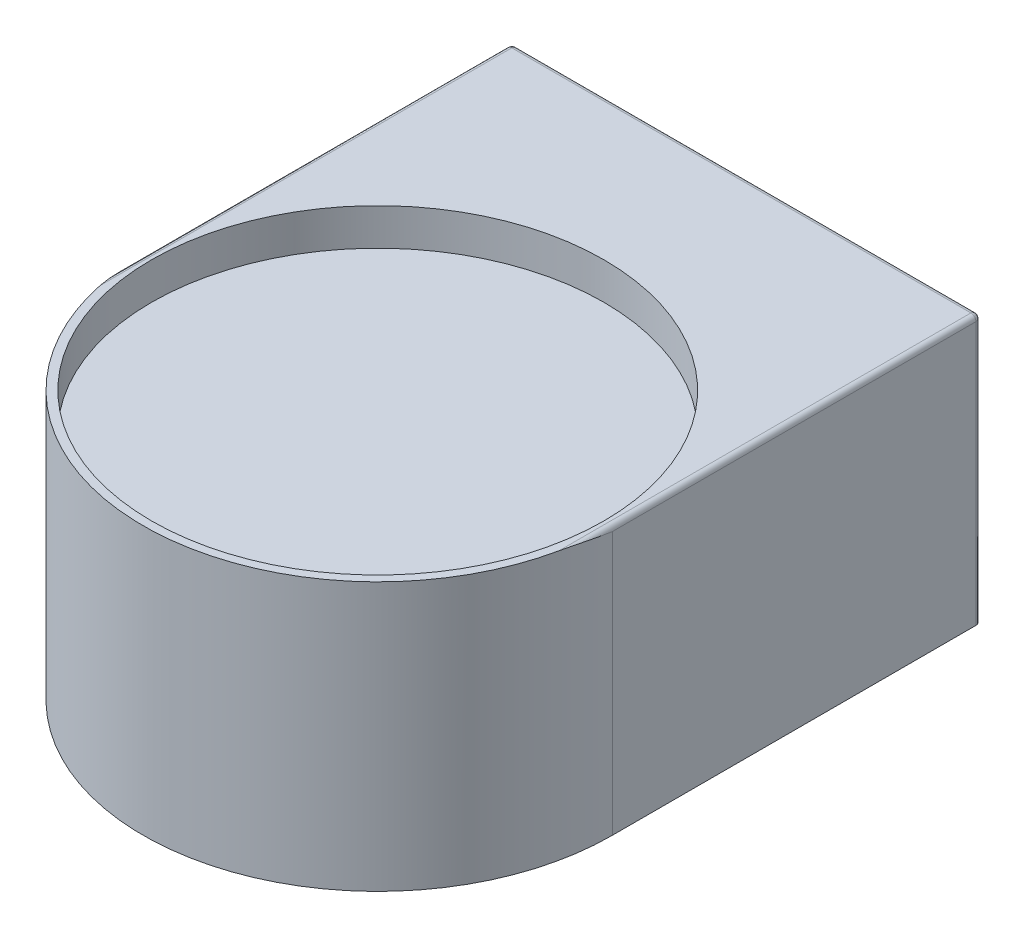
ISO-10303-21;
HEADER;
FILE_DESCRIPTION(('STEP AP214'),'2;1');
FILE_NAME('part.step','',(''),(''),'','','');
FILE_SCHEMA(('AUTOMOTIVE_DESIGN { 1 0 10303 214 1 1 1 1 }'));
ENDSEC;
DATA;
#1=APPLICATION_CONTEXT('core data for automotive mechanical design processes');
#2=APPLICATION_PROTOCOL_DEFINITION('international standard','automotive_design',2000,#1);
#3=PRODUCT_CONTEXT('',#1,'mechanical');
#4=PRODUCT('Part','Part','',(#3));
#5=PRODUCT_RELATED_PRODUCT_CATEGORY('part','',(#4));
#6=PRODUCT_DEFINITION_FORMATION('','',#4);
#7=PRODUCT_DEFINITION_CONTEXT('part definition',#1,'design');
#8=PRODUCT_DEFINITION('design','',#6,#7);
#9=PRODUCT_DEFINITION_SHAPE('','',#8);
#10=(LENGTH_UNIT() NAMED_UNIT(*) SI_UNIT(.MILLI.,.METRE.));
#11=(NAMED_UNIT(*) PLANE_ANGLE_UNIT() SI_UNIT($,.RADIAN.));
#12=(NAMED_UNIT(*) SI_UNIT($,.STERADIAN.) SOLID_ANGLE_UNIT());
#13=UNCERTAINTY_MEASURE_WITH_UNIT(LENGTH_MEASURE(1.E-05),#10,'distance_accuracy_value','');
#14=(GEOMETRIC_REPRESENTATION_CONTEXT(3) GLOBAL_UNCERTAINTY_ASSIGNED_CONTEXT((#13)) GLOBAL_UNIT_ASSIGNED_CONTEXT((#10,
#11,#12)) REPRESENTATION_CONTEXT('',''));
#15=CARTESIAN_POINT('',(0.,0.,0.));
#16=DIRECTION('',(0.,0.,1.));
#17=DIRECTION('',(1.,0.,0.));
#18=AXIS2_PLACEMENT_3D('',#15,#16,#17);
#19=CARTESIAN_POINT('',(0.,-4.69090909090911,0.));
#20=DIRECTION('',(0.,1.,0.));
#21=DIRECTION('',(0.,0.,1.));
#22=AXIS2_PLACEMENT_3D('',#19,#20,#21);
#23=CYLINDRICAL_SURFACE('',#22,135.);
#24=CARTESIAN_POINT('',(0.,160.,0.));
#25=DIRECTION('',(0.,1.,0.));
#26=DIRECTION('',(0.,0.,1.));
#27=AXIS2_PLACEMENT_3D('',#24,#25,#26);
#28=CIRCLE('',#27,135.);
#29=CARTESIAN_POINT('',(0.,160.,135.));
#30=VERTEX_POINT('',#29);
#31=EDGE_CURVE('E240',#30,#30,#28,.T.);
#32=ORIENTED_EDGE('',*,*,#31,.T.);
#33=EDGE_LOOP('',(#32));
#34=FACE_BOUND('',#33,.T.);
#35=CARTESIAN_POINT('',(0.,138.,0.));
#36=DIRECTION('',(0.,-1.,0.));
#37=DIRECTION('',(0.,0.,-1.));
#38=AXIS2_PLACEMENT_3D('',#35,#36,#37);
#39=CIRCLE('',#38,135.);
#40=CARTESIAN_POINT('',(0.,138.,-135.));
#41=VERTEX_POINT('',#40);
#42=EDGE_CURVE('E11',#41,#41,#39,.F.);
#43=ORIENTED_EDGE('',*,*,#42,.F.);
#44=EDGE_LOOP('',(#43));
#45=FACE_BOUND('',#44,.T.);
#46=ADVANCED_FACE('F33',(#34,#45),#23,.F.);
#47=CARTESIAN_POINT('',(0.,160.,0.));
#48=DIRECTION('',(0.,-1.,0.));
#49=DIRECTION('',(0.,0.,-1.));
#50=AXIS2_PLACEMENT_3D('',#47,#48,#49);
#51=CYLINDRICAL_SURFACE('',#50,140.);
#52=CARTESIAN_POINT('',(0.,0.,0.));
#53=DIRECTION('',(0.,1.,0.));
#54=DIRECTION('',(0.,0.,1.));
#55=AXIS2_PLACEMENT_3D('',#52,#53,#54);
#56=CIRCLE('',#55,140.);
#57=CARTESIAN_POINT('',(-140.,0.,0.));
#58=VERTEX_POINT('',#57);
#59=CARTESIAN_POINT('',(140.,0.,0.));
#60=VERTEX_POINT('',#59);
#61=EDGE_CURVE('E112',#58,#60,#56,.T.);
#62=ORIENTED_EDGE('',*,*,#61,.T.);
#63=DIRECTION('',(0.,-1.,0.));
#64=VECTOR('',#63,1.);
#65=CARTESIAN_POINT('',(140.,160.,0.));
#66=LINE('',#65,#64);
#67=CARTESIAN_POINT('',(140.,157.,0.));
#68=VERTEX_POINT('',#67);
#69=EDGE_CURVE('E97',#68,#60,#66,.T.);
#70=ORIENTED_EDGE('',*,*,#69,.F.);
#71=CARTESIAN_POINT('',(137.,160.,28.8270706107991));
#72=CARTESIAN_POINT('',(137.051544541855,159.999996930656,28.5821066152766));
#73=CARTESIAN_POINT('',(137.102431236093,159.998671921808,28.3370077506468));
#74=CARTESIAN_POINT('',(137.202883492568,159.993554952764,27.8465691345094));
#75=CARTESIAN_POINT('',(137.252449076849,159.98976303376,27.6012293870922));
#76=CARTESIAN_POINT('',(137.399145668618,159.97495352466,26.8649445162324));
#77=CARTESIAN_POINT('',(137.49429010377,159.960502088333,26.3736691822973));
#78=CARTESIAN_POINT('',(137.6792335934,159.923615698855,25.3905255481396));
#79=CARTESIAN_POINT('',(137.769033730749,159.901182369483,24.8986573887851));
#80=CARTESIAN_POINT('',(137.943303052374,159.849287414931,23.9143259823607));
#81=CARTESIAN_POINT('',(138.027771938763,159.819825397456,23.4218627036022));
#82=CARTESIAN_POINT('',(138.267017451614,159.724596055001,21.9808094023394));
#83=CARTESIAN_POINT('',(138.414574881376,159.650450560498,21.0315610649272));
#84=CARTESIAN_POINT('',(138.689932418966,159.48394662101,19.131755952694));
#85=CARTESIAN_POINT('',(138.817730700018,159.391586493837,18.1811990650815));
#86=CARTESIAN_POINT('',(139.053649567885,159.192343569326,16.2788651846211));
#87=CARTESIAN_POINT('',(139.161763908695,159.085456180998,15.3270879006664));
#88=CARTESIAN_POINT('',(139.358328106387,158.860271659268,13.4228398194572));
#89=CARTESIAN_POINT('',(139.446777181432,158.741974072496,12.4703689961394));
#90=CARTESIAN_POINT('',(139.682781907951,158.37394531321,9.61140687545686));
#91=CARTESIAN_POINT('',(139.800903089861,158.111160275206,7.70410854604141));
#92=CARTESIAN_POINT('',(139.958987202305,157.569215828585,3.88915605173734));
#93=CARTESIAN_POINT('',(139.998971687232,157.290060957558,1.98150213020023));
#94=CARTESIAN_POINT('',(139.999993471975,157.007225950898,0.049362651041102));
#95=CARTESIAN_POINT('',(139.999999998732,157.00361297224,0.0246813084382035));
#96=CARTESIAN_POINT('',(140.,157.,0.));
#97=B_SPLINE_CURVE_WITH_KNOTS('',3,(#71,#72,#73,#74,#75,#76,#77,#78,#79,#80,#81,#82,#83,#84,#85,
#86,#87,#88,#89,#90,#91,#92,#93,#94,#95,#96),.UNSPECIFIED.,.F.,.F.,(4,2,2,2,2,2,2,2,2,2,2,2,4),
(0.,0.750974288515512,1.5019360377118,3.00366159057737,4.50508181780869,6.00658586397522,
8.89663461183702,11.7869503912648,14.6781817181725,17.5695279718398,23.3544767027828,
29.1378294016918,29.2126625519889),.UNSPECIFIED.);
#98=CARTESIAN_POINT('',(137.,160.,28.8270706107991));
#99=VERTEX_POINT('',#98);
#100=EDGE_CURVE('E141',#68,#99,#97,.F.);
#101=ORIENTED_EDGE('',*,*,#100,.T.);
#102=CARTESIAN_POINT('',(0.,160.,0.));
#103=DIRECTION('',(0.,1.,0.));
#104=DIRECTION('',(0.,0.,1.));
#105=AXIS2_PLACEMENT_3D('',#102,#103,#104);
#106=CIRCLE('',#105,140.);
#107=CARTESIAN_POINT('',(-137.,160.,28.8270706107991));
#108=VERTEX_POINT('',#107);
#109=EDGE_CURVE('E131',#108,#99,#106,.T.);
#110=ORIENTED_EDGE('',*,*,#109,.F.);
#111=CARTESIAN_POINT('',(-137.,160.,28.8270706107991));
#112=CARTESIAN_POINT('',(-137.051544541855,159.999996930656,28.5821066152766));
#113=CARTESIAN_POINT('',(-137.102431236093,159.998671921808,28.3370077506468));
#114=CARTESIAN_POINT('',(-137.202883492568,159.993554952764,27.8465691345094));
#115=CARTESIAN_POINT('',(-137.252449076849,159.98976303376,27.6012293870922));
#116=CARTESIAN_POINT('',(-137.399145668618,159.97495352466,26.8649445162324));
#117=CARTESIAN_POINT('',(-137.49429010377,159.960502088333,26.3736691822973));
#118=CARTESIAN_POINT('',(-137.6792335934,159.923615698855,25.3905255481396));
#119=CARTESIAN_POINT('',(-137.769033730749,159.901182369483,24.8986573887851));
#120=CARTESIAN_POINT('',(-137.943303052374,159.849287414931,23.9143259823607));
#121=CARTESIAN_POINT('',(-138.027771938763,159.819825397456,23.4218627036022));
#122=CARTESIAN_POINT('',(-138.267017451614,159.724596055001,21.9808094023394));
#123=CARTESIAN_POINT('',(-138.414574881376,159.650450560498,21.0315610649272));
#124=CARTESIAN_POINT('',(-138.689932418966,159.48394662101,19.131755952694));
#125=CARTESIAN_POINT('',(-138.817730700018,159.391586493837,18.1811990650815));
#126=CARTESIAN_POINT('',(-139.053649567885,159.192343569326,16.2788651846211));
#127=CARTESIAN_POINT('',(-139.161763908695,159.085456180998,15.3270879006664));
#128=CARTESIAN_POINT('',(-139.358328106387,158.860271659268,13.4228398194572));
#129=CARTESIAN_POINT('',(-139.446777181432,158.741974072496,12.4703689961394));
#130=CARTESIAN_POINT('',(-139.682781907951,158.37394531321,9.61140687545686));
#131=CARTESIAN_POINT('',(-139.800903089861,158.111160275206,7.70410854604141));
#132=CARTESIAN_POINT('',(-139.958987202305,157.569215828585,3.88915605173734));
#133=CARTESIAN_POINT('',(-139.998971687232,157.290060957558,1.98150213020023));
#134=CARTESIAN_POINT('',(-139.999993471975,157.007225950898,0.049362651041102));
#135=CARTESIAN_POINT('',(-139.999999998732,157.00361297224,0.0246813084382035));
#136=CARTESIAN_POINT('',(-140.,157.,0.));
#137=B_SPLINE_CURVE_WITH_KNOTS('',3,(#111,#112,#113,#114,#115,#116,#117,#118,#119,#120,#121,
#122,#123,#124,#125,#126,#127,#128,#129,#130,#131,#132,#133,#134,#135,#136),.UNSPECIFIED.,.F.,
.F.,(4,2,2,2,2,2,2,2,2,2,2,2,4),(0.,0.750974288515512,1.5019360377118,3.00366159057737,
4.50508181780869,6.00658586397522,8.89663461183702,11.7869503912648,14.6781817181725,
17.5695279718398,23.3544767027828,29.1378294016918,29.2126625519889),.UNSPECIFIED.);
#138=CARTESIAN_POINT('',(-140.,157.,0.));
#139=VERTEX_POINT('',#138);
#140=EDGE_CURVE('E147',#108,#139,#137,.T.);
#141=ORIENTED_EDGE('',*,*,#140,.T.);
#142=DIRECTION('',(0.,-1.,0.));
#143=VECTOR('',#142,1.);
#144=CARTESIAN_POINT('',(-140.,160.,0.));
#145=LINE('',#144,#143);
#146=EDGE_CURVE('E106',#139,#58,#145,.T.);
#147=ORIENTED_EDGE('',*,*,#146,.T.);
#148=EDGE_LOOP('',(#62,#70,#101,#110,#141,#147));
#149=FACE_BOUND('',#148,.T.);
#150=ADVANCED_FACE('F35',(#149),#51,.T.);
#151=CARTESIAN_POINT('',(140.,160.,0.));
#152=DIRECTION('',(-1.,0.,0.));
#153=DIRECTION('',(0.,0.,1.));
#154=AXIS2_PLACEMENT_3D('',#151,#152,#153);
#155=PLANE('',#154);
#156=DIRECTION('',(0.,-1.,0.));
#157=VECTOR('',#156,1.);
#158=CARTESIAN_POINT('',(140.,160.,-217.));
#159=LINE('',#158,#157);
#160=CARTESIAN_POINT('',(140.,0.,-217.));
#161=VERTEX_POINT('',#160);
#162=CARTESIAN_POINT('',(140.,157.,-217.));
#163=VERTEX_POINT('',#162);
#164=EDGE_CURVE('E42',#161,#163,#159,.F.);
#165=ORIENTED_EDGE('',*,*,#164,.T.);
#166=DIRECTION('',(0.,0.,-1.));
#167=VECTOR('',#166,1.);
#168=CARTESIAN_POINT('',(140.,157.,0.));
#169=LINE('',#168,#167);
#170=EDGE_CURVE('E101',#163,#68,#169,.F.);
#171=ORIENTED_EDGE('',*,*,#170,.T.);
#172=ORIENTED_EDGE('',*,*,#69,.T.);
#173=DIRECTION('',(0.,0.,-1.));
#174=VECTOR('',#173,1.);
#175=CARTESIAN_POINT('',(140.,0.,0.));
#176=LINE('',#175,#174);
#177=EDGE_CURVE('E100',#60,#161,#176,.T.);
#178=ORIENTED_EDGE('',*,*,#177,.T.);
#179=EDGE_LOOP('',(#165,#171,#172,#178));
#180=FACE_BOUND('',#179,.T.);
#181=ADVANCED_FACE('F99',(#180),#155,.F.);
#182=CARTESIAN_POINT('',(-140.,160.,-220.));
#183=DIRECTION('',(0.,0.,1.));
#184=DIRECTION('',(1.,0.,0.));
#185=AXIS2_PLACEMENT_3D('',#182,#183,#184);
#186=PLANE('',#185);
#187=DIRECTION('',(0.,-1.,0.));
#188=VECTOR('',#187,1.);
#189=CARTESIAN_POINT('',(-137.,160.,-220.));
#190=LINE('',#189,#188);
#191=CARTESIAN_POINT('',(-137.,0.,-220.));
#192=VERTEX_POINT('',#191);
#193=CARTESIAN_POINT('',(-137.,157.,-220.));
#194=VERTEX_POINT('',#193);
#195=EDGE_CURVE('E216',#192,#194,#190,.F.);
#196=ORIENTED_EDGE('',*,*,#195,.T.);
#197=DIRECTION('',(-1.,0.,0.));
#198=VECTOR('',#197,1.);
#199=CARTESIAN_POINT('',(140.,157.,-220.));
#200=LINE('',#199,#198);
#201=CARTESIAN_POINT('',(137.,157.,-220.));
#202=VERTEX_POINT('',#201);
#203=EDGE_CURVE('E56',#194,#202,#200,.F.);
#204=ORIENTED_EDGE('',*,*,#203,.T.);
#205=DIRECTION('',(0.,-1.,0.));
#206=VECTOR('',#205,1.);
#207=CARTESIAN_POINT('',(137.,160.,-220.));
#208=LINE('',#207,#206);
#209=CARTESIAN_POINT('',(137.,0.,-220.));
#210=VERTEX_POINT('',#209);
#211=EDGE_CURVE('E218',#202,#210,#208,.T.);
#212=ORIENTED_EDGE('',*,*,#211,.T.);
#213=DIRECTION('',(-1.,0.,0.));
#214=VECTOR('',#213,1.);
#215=CARTESIAN_POINT('',(-140.,0.,-220.));
#216=LINE('',#215,#214);
#217=EDGE_CURVE('E116',#210,#192,#216,.T.);
#218=ORIENTED_EDGE('',*,*,#217,.T.);
#219=EDGE_LOOP('',(#196,#204,#212,#218));
#220=FACE_BOUND('',#219,.T.);
#221=ADVANCED_FACE('F174',(#220),#186,.F.);
#222=CARTESIAN_POINT('',(-140.,160.,0.));
#223=DIRECTION('',(1.,0.,0.));
#224=DIRECTION('',(0.,0.,-1.));
#225=AXIS2_PLACEMENT_3D('',#222,#223,#224);
#226=PLANE('',#225);
#227=DIRECTION('',(0.,0.,1.));
#228=VECTOR('',#227,1.);
#229=CARTESIAN_POINT('',(-140.,0.,0.));
#230=LINE('',#229,#228);
#231=CARTESIAN_POINT('',(-140.,0.,-217.));
#232=VERTEX_POINT('',#231);
#233=EDGE_CURVE('E129',#232,#58,#230,.T.);
#234=ORIENTED_EDGE('',*,*,#233,.T.);
#235=ORIENTED_EDGE('',*,*,#146,.F.);
#236=DIRECTION('',(0.,0.,1.));
#237=VECTOR('',#236,1.);
#238=CARTESIAN_POINT('',(-140.,157.,-220.));
#239=LINE('',#238,#237);
#240=CARTESIAN_POINT('',(-140.,157.,-217.));
#241=VERTEX_POINT('',#240);
#242=EDGE_CURVE('E220',#139,#241,#239,.F.);
#243=ORIENTED_EDGE('',*,*,#242,.T.);
#244=DIRECTION('',(0.,-1.,0.));
#245=VECTOR('',#244,1.);
#246=CARTESIAN_POINT('',(-140.,160.,-217.));
#247=LINE('',#246,#245);
#248=EDGE_CURVE('E214',#241,#232,#247,.T.);
#249=ORIENTED_EDGE('',*,*,#248,.T.);
#250=EDGE_LOOP('',(#234,#235,#243,#249));
#251=FACE_BOUND('',#250,.T.);
#252=ADVANCED_FACE('F170',(#251),#226,.F.);
#253=CARTESIAN_POINT('',(0.,160.,0.));
#254=DIRECTION('',(0.,1.,0.));
#255=DIRECTION('',(0.,0.,1.));
#256=AXIS2_PLACEMENT_3D('',#253,#254,#255);
#257=PLANE('',#256);
#258=ORIENTED_EDGE('',*,*,#31,.F.);
#259=EDGE_LOOP('',(#258));
#260=FACE_BOUND('',#259,.T.);
#261=DIRECTION('',(-1.,0.,0.));
#262=VECTOR('',#261,1.);
#263=CARTESIAN_POINT('',(-140.,160.,-217.));
#264=LINE('',#263,#262);
#265=CARTESIAN_POINT('',(137.,160.,-217.));
#266=VERTEX_POINT('',#265);
#267=CARTESIAN_POINT('',(-137.,160.,-217.));
#268=VERTEX_POINT('',#267);
#269=EDGE_CURVE('E136',#266,#268,#264,.T.);
#270=ORIENTED_EDGE('',*,*,#269,.T.);
#271=DIRECTION('',(0.,0.,1.));
#272=VECTOR('',#271,1.);
#273=CARTESIAN_POINT('',(-137.,160.,0.));
#274=LINE('',#273,#272);
#275=EDGE_CURVE('E138',#268,#108,#274,.T.);
#276=ORIENTED_EDGE('',*,*,#275,.T.);
#277=ORIENTED_EDGE('',*,*,#109,.T.);
#278=DIRECTION('',(0.,0.,-1.));
#279=VECTOR('',#278,1.);
#280=CARTESIAN_POINT('',(137.,160.,-220.));
#281=LINE('',#280,#279);
#282=EDGE_CURVE('E105',#99,#266,#281,.T.);
#283=ORIENTED_EDGE('',*,*,#282,.T.);
#284=EDGE_LOOP('',(#270,#276,#277,#283));
#285=FACE_BOUND('',#284,.T.);
#286=ADVANCED_FACE('F167',(#260,#285),#257,.T.);
#287=CARTESIAN_POINT('',(0.,0.,0.));
#288=DIRECTION('',(0.,1.,0.));
#289=DIRECTION('',(0.,0.,1.));
#290=AXIS2_PLACEMENT_3D('',#287,#288,#289);
#291=PLANE('',#290);
#292=ORIENTED_EDGE('',*,*,#233,.F.);
#293=CARTESIAN_POINT('',(-137.,0.,-217.));
#294=DIRECTION('',(0.,1.,0.));
#295=DIRECTION('',(0.,0.,1.));
#296=AXIS2_PLACEMENT_3D('',#293,#294,#295);
#297=CIRCLE('',#296,3.);
#298=EDGE_CURVE('E212',#232,#192,#297,.F.);
#299=ORIENTED_EDGE('',*,*,#298,.T.);
#300=ORIENTED_EDGE('',*,*,#217,.F.);
#301=CARTESIAN_POINT('',(137.,0.,-217.));
#302=DIRECTION('',(0.,1.,0.));
#303=DIRECTION('',(0.,0.,1.));
#304=AXIS2_PLACEMENT_3D('',#301,#302,#303);
#305=CIRCLE('',#304,3.);
#306=EDGE_CURVE('E115',#210,#161,#305,.F.);
#307=ORIENTED_EDGE('',*,*,#306,.T.);
#308=ORIENTED_EDGE('',*,*,#177,.F.);
#309=ORIENTED_EDGE('',*,*,#61,.F.);
#310=EDGE_LOOP('',(#292,#299,#300,#307,#308,#309));
#311=FACE_BOUND('',#310,.T.);
#312=ADVANCED_FACE('F111',(#311),#291,.F.);
#313=CARTESIAN_POINT('',(137.,160.,-217.));
#314=DIRECTION('',(0.,-1.,0.));
#315=DIRECTION('',(0.,0.,-1.));
#316=AXIS2_PLACEMENT_3D('',#313,#314,#315);
#317=CYLINDRICAL_SURFACE('',#316,3.);
#318=ORIENTED_EDGE('',*,*,#306,.F.);
#319=ORIENTED_EDGE('',*,*,#211,.F.);
#320=CARTESIAN_POINT('',(137.,157.,-217.));
#321=DIRECTION('',(0.,1.,0.));
#322=DIRECTION('',(0.,0.,1.));
#323=AXIS2_PLACEMENT_3D('',#320,#321,#322);
#324=CIRCLE('',#323,3.);
#325=EDGE_CURVE('E120',#163,#202,#324,.T.);
#326=ORIENTED_EDGE('',*,*,#325,.F.);
#327=ORIENTED_EDGE('',*,*,#164,.F.);
#328=EDGE_LOOP('',(#318,#319,#326,#327));
#329=FACE_BOUND('',#328,.T.);
#330=ADVANCED_FACE('F159',(#329),#317,.T.);
#331=CARTESIAN_POINT('',(137.,157.,0.));
#332=DIRECTION('',(0.,0.,1.));
#333=DIRECTION('',(1.,0.,0.));
#334=AXIS2_PLACEMENT_3D('',#331,#332,#333);
#335=CYLINDRICAL_SURFACE('',#334,3.);
#336=ORIENTED_EDGE('',*,*,#100,.F.);
#337=ORIENTED_EDGE('',*,*,#170,.F.);
#338=CARTESIAN_POINT('',(137.,157.,-217.));
#339=DIRECTION('',(0.,0.,-1.));
#340=DIRECTION('',(-1.,0.,0.));
#341=AXIS2_PLACEMENT_3D('',#338,#339,#340);
#342=CIRCLE('',#341,3.);
#343=EDGE_CURVE('E123',#266,#163,#342,.T.);
#344=ORIENTED_EDGE('',*,*,#343,.F.);
#345=ORIENTED_EDGE('',*,*,#282,.F.);
#346=EDGE_LOOP('',(#336,#337,#344,#345));
#347=FACE_BOUND('',#346,.T.);
#348=ADVANCED_FACE('F153',(#347),#335,.T.);
#349=CARTESIAN_POINT('',(137.,157.,-217.));
#350=DIRECTION('',(0.,0.,1.));
#351=DIRECTION('',(1.,0.,0.));
#352=AXIS2_PLACEMENT_3D('',#349,#350,#351);
#353=SPHERICAL_SURFACE('',#352,3.);
#354=ORIENTED_EDGE('',*,*,#343,.T.);
#355=ORIENTED_EDGE('',*,*,#325,.T.);
#356=CARTESIAN_POINT('',(137.,157.,-217.));
#357=DIRECTION('',(1.,0.,0.));
#358=DIRECTION('',(0.,0.,-1.));
#359=AXIS2_PLACEMENT_3D('',#356,#357,#358);
#360=CIRCLE('',#359,3.);
#361=EDGE_CURVE('E233',#266,#202,#360,.F.);
#362=ORIENTED_EDGE('',*,*,#361,.F.);
#363=EDGE_LOOP('',(#354,#355,#362));
#364=FACE_BOUND('',#363,.T.);
#365=ADVANCED_FACE('F158',(#364),#353,.T.);
#366=CARTESIAN_POINT('',(-137.,160.,-217.));
#367=DIRECTION('',(0.,-1.,0.));
#368=DIRECTION('',(0.,0.,-1.));
#369=AXIS2_PLACEMENT_3D('',#366,#367,#368);
#370=CYLINDRICAL_SURFACE('',#369,3.);
#371=ORIENTED_EDGE('',*,*,#298,.F.);
#372=ORIENTED_EDGE('',*,*,#248,.F.);
#373=CARTESIAN_POINT('',(-137.,157.,-217.));
#374=DIRECTION('',(0.,1.,0.));
#375=DIRECTION('',(0.,0.,1.));
#376=AXIS2_PLACEMENT_3D('',#373,#374,#375);
#377=CIRCLE('',#376,3.);
#378=EDGE_CURVE('E234',#194,#241,#377,.T.);
#379=ORIENTED_EDGE('',*,*,#378,.F.);
#380=ORIENTED_EDGE('',*,*,#195,.F.);
#381=EDGE_LOOP('',(#371,#372,#379,#380));
#382=FACE_BOUND('',#381,.T.);
#383=ADVANCED_FACE('F201',(#382),#370,.T.);
#384=CARTESIAN_POINT('',(0.,157.,-217.));
#385=DIRECTION('',(1.,0.,0.));
#386=DIRECTION('',(0.,0.,-1.));
#387=AXIS2_PLACEMENT_3D('',#384,#385,#386);
#388=CYLINDRICAL_SURFACE('',#387,3.);
#389=ORIENTED_EDGE('',*,*,#361,.T.);
#390=ORIENTED_EDGE('',*,*,#203,.F.);
#391=CARTESIAN_POINT('',(-137.,157.,-217.));
#392=DIRECTION('',(-1.,0.,0.));
#393=DIRECTION('',(0.,0.,1.));
#394=AXIS2_PLACEMENT_3D('',#391,#392,#393);
#395=CIRCLE('',#394,3.);
#396=EDGE_CURVE('E230',#268,#194,#395,.T.);
#397=ORIENTED_EDGE('',*,*,#396,.F.);
#398=ORIENTED_EDGE('',*,*,#269,.F.);
#399=EDGE_LOOP('',(#389,#390,#397,#398));
#400=FACE_BOUND('',#399,.T.);
#401=ADVANCED_FACE('F198',(#400),#388,.T.);
#402=CARTESIAN_POINT('',(-137.,157.,-217.));
#403=DIRECTION('',(0.,0.,1.));
#404=DIRECTION('',(1.,0.,0.));
#405=AXIS2_PLACEMENT_3D('',#402,#403,#404);
#406=SPHERICAL_SURFACE('',#405,3.);
#407=ORIENTED_EDGE('',*,*,#396,.T.);
#408=ORIENTED_EDGE('',*,*,#378,.T.);
#409=CARTESIAN_POINT('',(-137.,157.,-217.));
#410=DIRECTION('',(0.,0.,-1.));
#411=DIRECTION('',(-1.,0.,0.));
#412=AXIS2_PLACEMENT_3D('',#409,#410,#411);
#413=CIRCLE('',#412,3.);
#414=EDGE_CURVE('E237',#268,#241,#413,.F.);
#415=ORIENTED_EDGE('',*,*,#414,.F.);
#416=EDGE_LOOP('',(#407,#408,#415));
#417=FACE_BOUND('',#416,.T.);
#418=ADVANCED_FACE('F194',(#417),#406,.T.);
#419=CARTESIAN_POINT('',(-137.,157.,0.));
#420=DIRECTION('',(0.,0.,-1.));
#421=DIRECTION('',(-1.,0.,0.));
#422=AXIS2_PLACEMENT_3D('',#419,#420,#421);
#423=CYLINDRICAL_SURFACE('',#422,3.);
#424=ORIENTED_EDGE('',*,*,#414,.T.);
#425=ORIENTED_EDGE('',*,*,#242,.F.);
#426=ORIENTED_EDGE('',*,*,#140,.F.);
#427=ORIENTED_EDGE('',*,*,#275,.F.);
#428=EDGE_LOOP('',(#424,#425,#426,#427));
#429=FACE_BOUND('',#428,.T.);
#430=ADVANCED_FACE('F190',(#429),#423,.T.);
#431=CARTESIAN_POINT('',(-135.,138.,-214.));
#432=DIRECTION('',(0.,-1.,0.));
#433=DIRECTION('',(0.,0.,-1.));
#434=AXIS2_PLACEMENT_3D('',#431,#432,#433);
#435=PLANE('',#434);
#436=ORIENTED_EDGE('',*,*,#42,.T.);
#437=EDGE_LOOP('',(#436));
#438=FACE_BOUND('',#437,.T.);
#439=ADVANCED_FACE('F189',(#438),#435,.F.);
#440=CLOSED_SHELL('',(#46,#150,#181,#221,#252,#286,#312,#330,#348,#365,#383,#401,#418,#430,#439));
#441=MANIFOLD_SOLID_BREP('B2',#440);
#442=ADVANCED_BREP_SHAPE_REPRESENTATION('',(#18,#441),#14);
#443=SHAPE_DEFINITION_REPRESENTATION(#9,#442);
ENDSEC;
END-ISO-10303-21;
